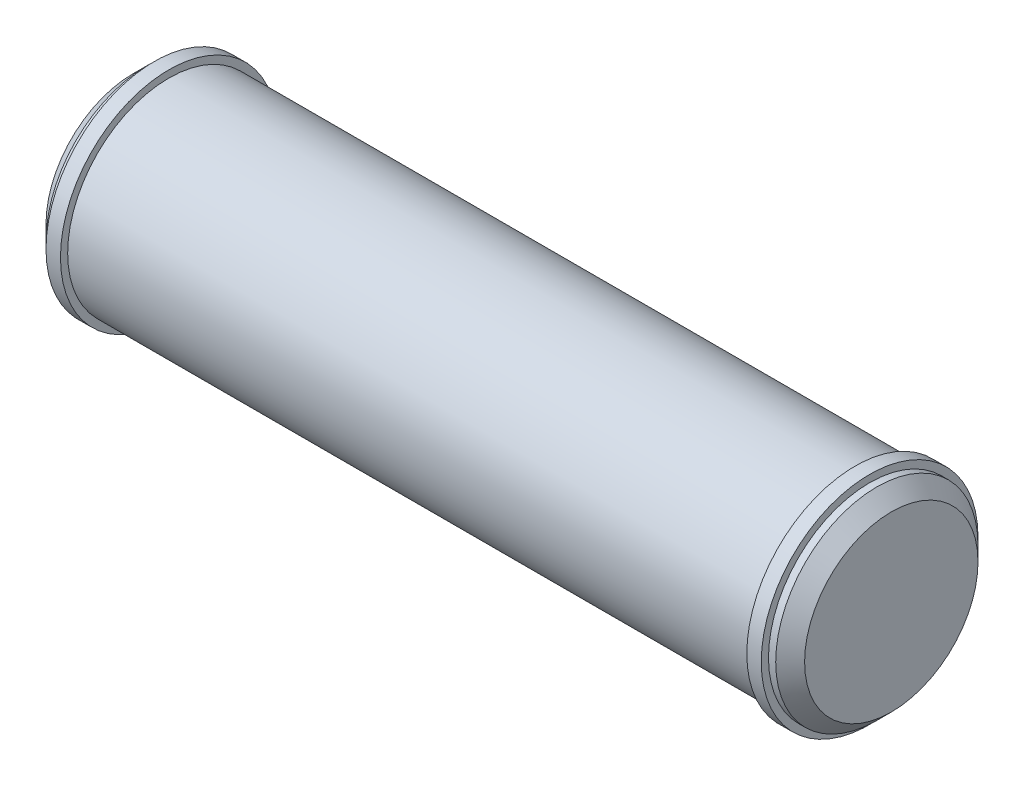
ISO-10303-21;
HEADER;
FILE_DESCRIPTION(('STEP AP214'),'2;1');
FILE_NAME('part.step','',(''),(''),'','','');
FILE_SCHEMA(('AUTOMOTIVE_DESIGN { 1 0 10303 214 1 1 1 1 }'));
ENDSEC;
DATA;
#1=APPLICATION_CONTEXT('core data for automotive mechanical design processes');
#2=APPLICATION_PROTOCOL_DEFINITION('international standard','automotive_design',2000,#1);
#3=PRODUCT_CONTEXT('',#1,'mechanical');
#4=PRODUCT('Part','Part','',(#3));
#5=PRODUCT_RELATED_PRODUCT_CATEGORY('part','',(#4));
#6=PRODUCT_DEFINITION_FORMATION('','',#4);
#7=PRODUCT_DEFINITION_CONTEXT('part definition',#1,'design');
#8=PRODUCT_DEFINITION('design','',#6,#7);
#9=PRODUCT_DEFINITION_SHAPE('','',#8);
#10=(LENGTH_UNIT() NAMED_UNIT(*) SI_UNIT(.MILLI.,.METRE.));
#11=(NAMED_UNIT(*) PLANE_ANGLE_UNIT() SI_UNIT($,.RADIAN.));
#12=(NAMED_UNIT(*) SI_UNIT($,.STERADIAN.) SOLID_ANGLE_UNIT());
#13=UNCERTAINTY_MEASURE_WITH_UNIT(LENGTH_MEASURE(1.E-05),#10,'distance_accuracy_value','');
#14=(GEOMETRIC_REPRESENTATION_CONTEXT(3) GLOBAL_UNCERTAINTY_ASSIGNED_CONTEXT((#13)) GLOBAL_UNIT_ASSIGNED_CONTEXT((#10,
#11,#12)) REPRESENTATION_CONTEXT('',''));
#15=CARTESIAN_POINT('',(0.,0.,0.));
#16=DIRECTION('',(0.,0.,1.));
#17=DIRECTION('',(1.,0.,0.));
#18=AXIS2_PLACEMENT_3D('',#15,#16,#17);
#19=CARTESIAN_POINT('',(-632.82026396794,0.,0.));
#20=DIRECTION('',(-1.,0.,0.));
#21=DIRECTION('',(0.,0.,1.));
#22=AXIS2_PLACEMENT_3D('',#19,#20,#21);
#23=CYLINDRICAL_SURFACE('',#22,15.);
#24=CARTESIAN_POINT('',(-49.5,0.,0.));
#25=DIRECTION('',(-1.,0.,0.));
#26=DIRECTION('',(0.,0.,1.));
#27=AXIS2_PLACEMENT_3D('',#24,#25,#26);
#28=CIRCLE('',#27,15.);
#29=CARTESIAN_POINT('',(-49.5,0.,15.));
#30=VERTEX_POINT('',#29);
#31=EDGE_CURVE('E73',#30,#30,#28,.T.);
#32=ORIENTED_EDGE('',*,*,#31,.F.);
#33=EDGE_LOOP('',(#32));
#34=FACE_BOUND('',#33,.T.);
#35=CARTESIAN_POINT('',(-47.5,0.,0.));
#36=DIRECTION('',(-1.,0.,0.));
#37=DIRECTION('',(0.,0.,1.));
#38=AXIS2_PLACEMENT_3D('',#35,#36,#37);
#39=CIRCLE('',#38,15.);
#40=CARTESIAN_POINT('',(-47.5,0.,15.));
#41=VERTEX_POINT('',#40);
#42=EDGE_CURVE('E10',#41,#41,#39,.T.);
#43=ORIENTED_EDGE('',*,*,#42,.T.);
#44=EDGE_LOOP('',(#43));
#45=FACE_BOUND('',#44,.T.);
#46=ADVANCED_FACE('F33',(#34,#45),#23,.T.);
#47=CARTESIAN_POINT('',(-47.5,15.,0.));
#48=DIRECTION('',(-1.,0.,0.));
#49=DIRECTION('',(0.,0.,1.));
#50=AXIS2_PLACEMENT_3D('',#47,#48,#49);
#51=PLANE('',#50);
#52=ORIENTED_EDGE('',*,*,#42,.F.);
#53=EDGE_LOOP('',(#52));
#54=FACE_BOUND('',#53,.T.);
#55=CARTESIAN_POINT('',(-47.5,0.,0.));
#56=DIRECTION('',(-1.,0.,0.));
#57=DIRECTION('',(0.,0.,1.));
#58=AXIS2_PLACEMENT_3D('',#55,#56,#57);
#59=CIRCLE('',#58,14.);
#60=CARTESIAN_POINT('',(-47.5,0.,14.));
#61=VERTEX_POINT('',#60);
#62=EDGE_CURVE('E39',#61,#61,#59,.T.);
#63=ORIENTED_EDGE('',*,*,#62,.T.);
#64=EDGE_LOOP('',(#63));
#65=FACE_BOUND('',#64,.T.);
#66=ADVANCED_FACE('F80',(#54,#65),#51,.F.);
#67=CARTESIAN_POINT('',(-632.82026396794,0.,0.));
#68=DIRECTION('',(-1.,0.,0.));
#69=DIRECTION('',(0.,0.,1.));
#70=AXIS2_PLACEMENT_3D('',#67,#68,#69);
#71=CYLINDRICAL_SURFACE('',#70,14.);
#72=ORIENTED_EDGE('',*,*,#62,.F.);
#73=EDGE_LOOP('',(#72));
#74=FACE_BOUND('',#73,.T.);
#75=CARTESIAN_POINT('',(47.5,0.,0.));
#76=DIRECTION('',(-1.,0.,0.));
#77=DIRECTION('',(0.,0.,1.));
#78=AXIS2_PLACEMENT_3D('',#75,#76,#77);
#79=CIRCLE('',#78,14.);
#80=CARTESIAN_POINT('',(47.5,0.,14.));
#81=VERTEX_POINT('',#80);
#82=EDGE_CURVE('E43',#81,#81,#79,.T.);
#83=ORIENTED_EDGE('',*,*,#82,.T.);
#84=EDGE_LOOP('',(#83));
#85=FACE_BOUND('',#84,.T.);
#86=ADVANCED_FACE('F84',(#74,#85),#71,.T.);
#87=CARTESIAN_POINT('',(47.5,15.,0.));
#88=DIRECTION('',(1.,0.,0.));
#89=DIRECTION('',(0.,0.,-1.));
#90=AXIS2_PLACEMENT_3D('',#87,#88,#89);
#91=PLANE('',#90);
#92=ORIENTED_EDGE('',*,*,#82,.F.);
#93=EDGE_LOOP('',(#92));
#94=FACE_BOUND('',#93,.T.);
#95=CARTESIAN_POINT('',(47.5,0.,0.));
#96=DIRECTION('',(-1.,0.,0.));
#97=DIRECTION('',(0.,0.,1.));
#98=AXIS2_PLACEMENT_3D('',#95,#96,#97);
#99=CIRCLE('',#98,15.);
#100=CARTESIAN_POINT('',(47.5,0.,15.));
#101=VERTEX_POINT('',#100);
#102=EDGE_CURVE('E47',#101,#101,#99,.T.);
#103=ORIENTED_EDGE('',*,*,#102,.T.);
#104=EDGE_LOOP('',(#103));
#105=FACE_BOUND('',#104,.T.);
#106=ADVANCED_FACE('F89',(#94,#105),#91,.F.);
#107=CARTESIAN_POINT('',(-632.82026396794,0.,0.));
#108=DIRECTION('',(-1.,0.,0.));
#109=DIRECTION('',(0.,0.,1.));
#110=AXIS2_PLACEMENT_3D('',#107,#108,#109);
#111=CYLINDRICAL_SURFACE('',#110,15.);
#112=ORIENTED_EDGE('',*,*,#102,.F.);
#113=EDGE_LOOP('',(#112));
#114=FACE_BOUND('',#113,.T.);
#115=CARTESIAN_POINT('',(49.5,0.,0.));
#116=DIRECTION('',(-1.,0.,0.));
#117=DIRECTION('',(0.,0.,1.));
#118=AXIS2_PLACEMENT_3D('',#115,#116,#117);
#119=CIRCLE('',#118,15.);
#120=CARTESIAN_POINT('',(49.5,0.,15.));
#121=VERTEX_POINT('',#120);
#122=EDGE_CURVE('E52',#121,#121,#119,.T.);
#123=ORIENTED_EDGE('',*,*,#122,.T.);
#124=EDGE_LOOP('',(#123));
#125=FACE_BOUND('',#124,.T.);
#126=ADVANCED_FACE('F95',(#114,#125),#111,.T.);
#127=CARTESIAN_POINT('',(49.5,14.,0.));
#128=DIRECTION('',(-1.,0.,0.));
#129=DIRECTION('',(0.,0.,1.));
#130=AXIS2_PLACEMENT_3D('',#127,#128,#129);
#131=PLANE('',#130);
#132=ORIENTED_EDGE('',*,*,#122,.F.);
#133=EDGE_LOOP('',(#132));
#134=FACE_BOUND('',#133,.T.);
#135=CARTESIAN_POINT('',(49.5,0.,0.));
#136=DIRECTION('',(-1.,0.,0.));
#137=DIRECTION('',(0.,0.,1.));
#138=AXIS2_PLACEMENT_3D('',#135,#136,#137);
#139=CIRCLE('',#138,14.);
#140=CARTESIAN_POINT('',(49.5,0.,14.));
#141=VERTEX_POINT('',#140);
#142=EDGE_CURVE('E55',#141,#141,#139,.T.);
#143=ORIENTED_EDGE('',*,*,#142,.T.);
#144=EDGE_LOOP('',(#143));
#145=FACE_BOUND('',#144,.T.);
#146=ADVANCED_FACE('F99',(#134,#145),#131,.F.);
#147=CARTESIAN_POINT('',(-632.82026396794,0.,0.));
#148=DIRECTION('',(-1.,0.,0.));
#149=DIRECTION('',(0.,0.,1.));
#150=AXIS2_PLACEMENT_3D('',#147,#148,#149);
#151=CYLINDRICAL_SURFACE('',#150,14.);
#152=ORIENTED_EDGE('',*,*,#142,.F.);
#153=EDGE_LOOP('',(#152));
#154=FACE_BOUND('',#153,.T.);
#155=CARTESIAN_POINT('',(50.5,0.,0.));
#156=DIRECTION('',(-1.,0.,0.));
#157=DIRECTION('',(0.,0.,1.));
#158=AXIS2_PLACEMENT_3D('',#155,#156,#157);
#159=CIRCLE('',#158,14.);
#160=CARTESIAN_POINT('',(50.5,0.,14.));
#161=VERTEX_POINT('',#160);
#162=EDGE_CURVE('E58',#161,#161,#159,.T.);
#163=ORIENTED_EDGE('',*,*,#162,.T.);
#164=EDGE_LOOP('',(#163));
#165=FACE_BOUND('',#164,.T.);
#166=ADVANCED_FACE('F103',(#154,#165),#151,.T.);
#167=CARTESIAN_POINT('',(52.5,0.,0.));
#168=DIRECTION('',(-1.,0.,0.));
#169=DIRECTION('',(0.,0.,1.));
#170=AXIS2_PLACEMENT_3D('',#167,#168,#169);
#171=CONICAL_SURFACE('',#170,12.,0.785398163397446);
#172=ORIENTED_EDGE('',*,*,#162,.F.);
#173=EDGE_LOOP('',(#172));
#174=FACE_BOUND('',#173,.T.);
#175=CARTESIAN_POINT('',(52.5,0.,0.));
#176=DIRECTION('',(-1.,0.,0.));
#177=DIRECTION('',(0.,0.,1.));
#178=AXIS2_PLACEMENT_3D('',#175,#176,#177);
#179=CIRCLE('',#178,12.);
#180=CARTESIAN_POINT('',(52.5,0.,12.));
#181=VERTEX_POINT('',#180);
#182=EDGE_CURVE('E61',#181,#181,#179,.T.);
#183=ORIENTED_EDGE('',*,*,#182,.T.);
#184=EDGE_LOOP('',(#183));
#185=FACE_BOUND('',#184,.T.);
#186=ADVANCED_FACE('F107',(#174,#185),#171,.T.);
#187=CARTESIAN_POINT('',(52.5,0.,0.));
#188=DIRECTION('',(-1.,0.,0.));
#189=DIRECTION('',(0.,0.,1.));
#190=AXIS2_PLACEMENT_3D('',#187,#188,#189);
#191=PLANE('',#190);
#192=ORIENTED_EDGE('',*,*,#182,.F.);
#193=EDGE_LOOP('',(#192));
#194=FACE_BOUND('',#193,.T.);
#195=ADVANCED_FACE('F111',(#194),#191,.F.);
#196=CARTESIAN_POINT('',(-52.5,-4.21542976503946E-13,0.));
#197=DIRECTION('',(1.,0.,0.));
#198=DIRECTION('',(0.,0.,-1.));
#199=AXIS2_PLACEMENT_3D('',#196,#197,#198);
#200=PLANE('',#199);
#201=CARTESIAN_POINT('',(-52.5,0.,0.));
#202=DIRECTION('',(-1.,0.,0.));
#203=DIRECTION('',(0.,0.,1.));
#204=AXIS2_PLACEMENT_3D('',#201,#202,#203);
#205=CIRCLE('',#204,12.);
#206=CARTESIAN_POINT('',(-52.5,0.,12.));
#207=VERTEX_POINT('',#206);
#208=EDGE_CURVE('E64',#207,#207,#205,.T.);
#209=ORIENTED_EDGE('',*,*,#208,.T.);
#210=EDGE_LOOP('',(#209));
#211=FACE_BOUND('',#210,.T.);
#212=ADVANCED_FACE('F115',(#211),#200,.F.);
#213=CARTESIAN_POINT('',(-50.5,0.,0.));
#214=DIRECTION('',(1.,0.,0.));
#215=DIRECTION('',(0.,0.,-1.));
#216=AXIS2_PLACEMENT_3D('',#213,#214,#215);
#217=CONICAL_SURFACE('',#216,14.,0.785398163397446);
#218=ORIENTED_EDGE('',*,*,#208,.F.);
#219=EDGE_LOOP('',(#218));
#220=FACE_BOUND('',#219,.T.);
#221=CARTESIAN_POINT('',(-50.5,0.,0.));
#222=DIRECTION('',(-1.,0.,0.));
#223=DIRECTION('',(0.,0.,1.));
#224=AXIS2_PLACEMENT_3D('',#221,#222,#223);
#225=CIRCLE('',#224,14.);
#226=CARTESIAN_POINT('',(-50.5,0.,14.));
#227=VERTEX_POINT('',#226);
#228=EDGE_CURVE('E67',#227,#227,#225,.T.);
#229=ORIENTED_EDGE('',*,*,#228,.T.);
#230=EDGE_LOOP('',(#229));
#231=FACE_BOUND('',#230,.T.);
#232=ADVANCED_FACE('F119',(#220,#231),#217,.T.);
#233=CARTESIAN_POINT('',(-632.82026396794,0.,0.));
#234=DIRECTION('',(-1.,0.,0.));
#235=DIRECTION('',(0.,0.,1.));
#236=AXIS2_PLACEMENT_3D('',#233,#234,#235);
#237=CYLINDRICAL_SURFACE('',#236,14.);
#238=ORIENTED_EDGE('',*,*,#228,.F.);
#239=EDGE_LOOP('',(#238));
#240=FACE_BOUND('',#239,.T.);
#241=CARTESIAN_POINT('',(-49.5,0.,0.));
#242=DIRECTION('',(-1.,0.,0.));
#243=DIRECTION('',(0.,0.,1.));
#244=AXIS2_PLACEMENT_3D('',#241,#242,#243);
#245=CIRCLE('',#244,14.);
#246=CARTESIAN_POINT('',(-49.5,0.,14.));
#247=VERTEX_POINT('',#246);
#248=EDGE_CURVE('E70',#247,#247,#245,.T.);
#249=ORIENTED_EDGE('',*,*,#248,.T.);
#250=EDGE_LOOP('',(#249));
#251=FACE_BOUND('',#250,.T.);
#252=ADVANCED_FACE('F123',(#240,#251),#237,.T.);
#253=CARTESIAN_POINT('',(-49.5,14.,0.));
#254=DIRECTION('',(1.,0.,0.));
#255=DIRECTION('',(0.,0.,-1.));
#256=AXIS2_PLACEMENT_3D('',#253,#254,#255);
#257=PLANE('',#256);
#258=ORIENTED_EDGE('',*,*,#248,.F.);
#259=EDGE_LOOP('',(#258));
#260=FACE_BOUND('',#259,.T.);
#261=ORIENTED_EDGE('',*,*,#31,.T.);
#262=EDGE_LOOP('',(#261));
#263=FACE_BOUND('',#262,.T.);
#264=ADVANCED_FACE('F77',(#260,#263),#257,.F.);
#265=CLOSED_SHELL('',(#46,#66,#86,#106,#126,#146,#166,#186,#195,#212,#232,#252,#264));
#266=MANIFOLD_SOLID_BREP('B2',#265);
#267=ADVANCED_BREP_SHAPE_REPRESENTATION('',(#18,#266),#14);
#268=SHAPE_DEFINITION_REPRESENTATION(#9,#267);
ENDSEC;
END-ISO-10303-21;
